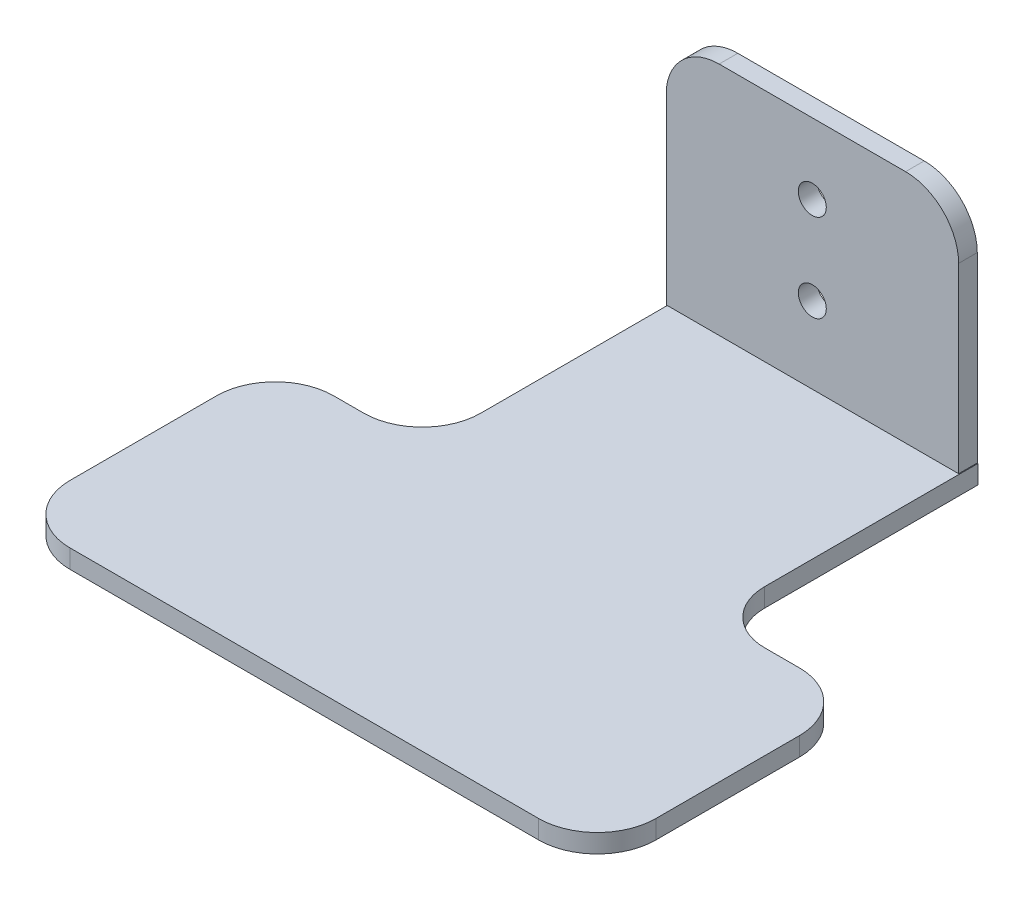
ISO-10303-21;
HEADER;
FILE_DESCRIPTION(('STEP AP214'),'2;1');
FILE_NAME('part.step','',(''),(''),'','','');
FILE_SCHEMA(('AUTOMOTIVE_DESIGN { 1 0 10303 214 1 1 1 1 }'));
ENDSEC;
DATA;
#1=APPLICATION_CONTEXT('core data for automotive mechanical design processes');
#2=APPLICATION_PROTOCOL_DEFINITION('international standard','automotive_design',2000,#1);
#3=PRODUCT_CONTEXT('',#1,'mechanical');
#4=PRODUCT('Part','Part','',(#3));
#5=PRODUCT_RELATED_PRODUCT_CATEGORY('part','',(#4));
#6=PRODUCT_DEFINITION_FORMATION('','',#4);
#7=PRODUCT_DEFINITION_CONTEXT('part definition',#1,'design');
#8=PRODUCT_DEFINITION('design','',#6,#7);
#9=PRODUCT_DEFINITION_SHAPE('','',#8);
#10=(LENGTH_UNIT() NAMED_UNIT(*) SI_UNIT(.MILLI.,.METRE.));
#11=(NAMED_UNIT(*) PLANE_ANGLE_UNIT() SI_UNIT($,.RADIAN.));
#12=(NAMED_UNIT(*) SI_UNIT($,.STERADIAN.) SOLID_ANGLE_UNIT());
#13=UNCERTAINTY_MEASURE_WITH_UNIT(LENGTH_MEASURE(1.E-05),#10,'distance_accuracy_value','');
#14=(GEOMETRIC_REPRESENTATION_CONTEXT(3) GLOBAL_UNCERTAINTY_ASSIGNED_CONTEXT((#13)) GLOBAL_UNIT_ASSIGNED_CONTEXT((#10,
#11,#12)) REPRESENTATION_CONTEXT('',''));
#15=CARTESIAN_POINT('',(0.,0.,0.));
#16=DIRECTION('',(0.,0.,1.));
#17=DIRECTION('',(1.,0.,0.));
#18=AXIS2_PLACEMENT_3D('',#15,#16,#17);
#19=CARTESIAN_POINT('',(22.8862511446096,34.2527379489032,3.18));
#20=DIRECTION('',(0.,0.,1.));
#21=DIRECTION('',(1.,0.,0.));
#22=AXIS2_PLACEMENT_3D('',#19,#20,#21);
#23=PLANE('',#22);
#24=DIRECTION('',(0.,-1.,0.));
#25=VECTOR('',#24,1.);
#26=CARTESIAN_POINT('',(-17.8002165675251,34.2527379489032,3.18));
#27=LINE('',#26,#25);
#28=CARTESIAN_POINT('',(-17.8002165675251,3.18,3.18));
#29=VERTEX_POINT('',#28);
#30=CARTESIAN_POINT('',(-17.8002165675251,0.349476153117412,3.18));
#31=VERTEX_POINT('',#30);
#32=EDGE_CURVE('E51',#29,#31,#27,.T.);
#33=ORIENTED_EDGE('',*,*,#32,.F.);
#34=DIRECTION('',(1.,0.,0.));
#35=VECTOR('',#34,1.);
#36=CARTESIAN_POINT('',(22.8862511446096,3.18,3.18));
#37=LINE('',#36,#35);
#38=CARTESIAN_POINT('',(31.9446232994355,3.18,3.18));
#39=VERTEX_POINT('',#38);
#40=EDGE_CURVE('E206',#29,#39,#37,.T.);
#41=ORIENTED_EDGE('',*,*,#40,.T.);
#42=DIRECTION('',(0.,1.,0.));
#43=VECTOR('',#42,1.);
#44=CARTESIAN_POINT('',(31.9446232994355,0.349476153117412,3.18));
#45=LINE('',#44,#43);
#46=CARTESIAN_POINT('',(31.9446232994355,34.2871040819025,3.18));
#47=VERTEX_POINT('',#46);
#48=EDGE_CURVE('E323',#39,#47,#45,.T.);
#49=ORIENTED_EDGE('',*,*,#48,.T.);
#50=CARTESIAN_POINT('',(22.8862511446096,34.2527379489032,3.18));
#51=DIRECTION('',(0.,0.,1.));
#52=DIRECTION('',(1.,0.,0.));
#53=AXIS2_PLACEMENT_3D('',#50,#51,#52);
#54=CIRCLE('',#53,9.05843734462087);
#55=CARTESIAN_POINT('',(22.8862511446096,43.3111752935241,3.18));
#56=VERTEX_POINT('',#55);
#57=EDGE_CURVE('E326',#47,#56,#54,.T.);
#58=ORIENTED_EDGE('',*,*,#57,.T.);
#59=DIRECTION('',(-1.,0.,0.));
#60=VECTOR('',#59,1.);
#61=CARTESIAN_POINT('',(-8.94233326088786,43.3111752935241,3.18));
#62=LINE('',#61,#60);
#63=CARTESIAN_POINT('',(-8.94233326088786,43.3111752935241,3.18));
#64=VERTEX_POINT('',#63);
#65=EDGE_CURVE('E328',#56,#64,#62,.T.);
#66=ORIENTED_EDGE('',*,*,#65,.T.);
#67=CARTESIAN_POINT('',(-8.94233326088786,34.2527379489032,3.18));
#68=DIRECTION('',(0.,0.,1.));
#69=DIRECTION('',(1.,0.,0.));
#70=AXIS2_PLACEMENT_3D('',#67,#68,#69);
#71=CIRCLE('',#70,9.05843734462087);
#72=CARTESIAN_POINT('',(-17.9252964655178,35.4196394831751,3.18));
#73=VERTEX_POINT('',#72);
#74=EDGE_CURVE('E330',#64,#73,#71,.T.);
#75=ORIENTED_EDGE('',*,*,#74,.T.);
#76=DIRECTION('',(0.,-1.,0.));
#77=VECTOR('',#76,1.);
#78=CARTESIAN_POINT('',(-17.9252964655178,35.4196394831751,3.18));
#79=LINE('',#78,#77);
#80=CARTESIAN_POINT('',(-17.9252964655178,0.349476153117412,3.18));
#81=VERTEX_POINT('',#80);
#82=EDGE_CURVE('E332',#73,#81,#79,.T.);
#83=ORIENTED_EDGE('',*,*,#82,.T.);
#84=DIRECTION('',(1.,0.,0.));
#85=VECTOR('',#84,1.);
#86=CARTESIAN_POINT('',(-17.9252964655178,0.349476153117412,3.18));
#87=LINE('',#86,#85);
#88=EDGE_CURVE('E321',#81,#31,#87,.T.);
#89=ORIENTED_EDGE('',*,*,#88,.T.);
#90=EDGE_LOOP('',(#33,#41,#49,#58,#66,#75,#83,#89));
#91=FACE_BOUND('',#90,.T.);
#92=CARTESIAN_POINT('',(6.95811985188034,16.2527381217677,3.18));
#93=DIRECTION('',(0.,0.,1.));
#94=DIRECTION('',(1.,0.,0.));
#95=AXIS2_PLACEMENT_3D('',#92,#93,#94);
#96=CIRCLE('',#95,2.39);
#97=CARTESIAN_POINT('',(9.34811985188034,16.2527381217677,3.18));
#98=VERTEX_POINT('',#97);
#99=EDGE_CURVE('E315',#98,#98,#96,.T.);
#100=ORIENTED_EDGE('',*,*,#99,.F.);
#101=EDGE_LOOP('',(#100));
#102=FACE_BOUND('',#101,.T.);
#103=CARTESIAN_POINT('',(6.95811985188034,31.2527379489032,3.18));
#104=DIRECTION('',(0.,0.,1.));
#105=DIRECTION('',(1.,0.,0.));
#106=AXIS2_PLACEMENT_3D('',#103,#104,#105);
#107=CIRCLE('',#106,2.39);
#108=CARTESIAN_POINT('',(9.34811985188034,31.2527379489032,3.18));
#109=VERTEX_POINT('',#108);
#110=EDGE_CURVE('E309',#109,#109,#107,.T.);
#111=ORIENTED_EDGE('',*,*,#110,.F.);
#112=EDGE_LOOP('',(#111));
#113=FACE_BOUND('',#112,.T.);
#114=ADVANCED_FACE('F36',(#91,#102,#113),#23,.T.);
#115=CARTESIAN_POINT('',(22.8862511446096,34.2527379489032,0.));
#116=DIRECTION('',(0.,0.,1.));
#117=DIRECTION('',(1.,0.,0.));
#118=AXIS2_PLACEMENT_3D('',#115,#116,#117);
#119=PLANE('',#118);
#120=DIRECTION('',(1.,0.,0.));
#121=VECTOR('',#120,1.);
#122=CARTESIAN_POINT('',(-17.9252964655178,0.349476153117412,0.));
#123=LINE('',#122,#121);
#124=CARTESIAN_POINT('',(-17.9252964655178,0.349476153117412,0.));
#125=VERTEX_POINT('',#124);
#126=CARTESIAN_POINT('',(31.9446232994355,0.349476153117412,0.));
#127=VERTEX_POINT('',#126);
#128=EDGE_CURVE('E318',#125,#127,#123,.T.);
#129=ORIENTED_EDGE('',*,*,#128,.F.);
#130=DIRECTION('',(0.,-1.,0.));
#131=VECTOR('',#130,1.);
#132=CARTESIAN_POINT('',(-17.9252964655178,35.4196394831751,0.));
#133=LINE('',#132,#131);
#134=CARTESIAN_POINT('',(-17.9252964655178,35.4196394831751,0.));
#135=VERTEX_POINT('',#134);
#136=EDGE_CURVE('E324',#135,#125,#133,.T.);
#137=ORIENTED_EDGE('',*,*,#136,.F.);
#138=CARTESIAN_POINT('',(-8.94233326088786,34.2527379489032,0.));
#139=DIRECTION('',(0.,0.,1.));
#140=DIRECTION('',(1.,0.,0.));
#141=AXIS2_PLACEMENT_3D('',#138,#139,#140);
#142=CIRCLE('',#141,9.05843734462087);
#143=CARTESIAN_POINT('',(-8.94233326088786,43.3111752935241,0.));
#144=VERTEX_POINT('',#143);
#145=EDGE_CURVE('E343',#144,#135,#142,.T.);
#146=ORIENTED_EDGE('',*,*,#145,.F.);
#147=DIRECTION('',(-1.,0.,0.));
#148=VECTOR('',#147,1.);
#149=CARTESIAN_POINT('',(-8.94233326088786,43.3111752935241,0.));
#150=LINE('',#149,#148);
#151=CARTESIAN_POINT('',(22.8862511446096,43.3111752935241,0.));
#152=VERTEX_POINT('',#151);
#153=EDGE_CURVE('E341',#152,#144,#150,.T.);
#154=ORIENTED_EDGE('',*,*,#153,.F.);
#155=CARTESIAN_POINT('',(22.8862511446096,34.2527379489032,0.));
#156=DIRECTION('',(0.,0.,1.));
#157=DIRECTION('',(1.,0.,0.));
#158=AXIS2_PLACEMENT_3D('',#155,#156,#157);
#159=CIRCLE('',#158,9.05843734462087);
#160=CARTESIAN_POINT('',(31.9446232994355,34.2871040819025,0.));
#161=VERTEX_POINT('',#160);
#162=EDGE_CURVE('E339',#161,#152,#159,.T.);
#163=ORIENTED_EDGE('',*,*,#162,.F.);
#164=DIRECTION('',(0.,1.,0.));
#165=VECTOR('',#164,1.);
#166=CARTESIAN_POINT('',(31.9446232994355,0.349476153117412,0.));
#167=LINE('',#166,#165);
#168=EDGE_CURVE('E337',#127,#161,#167,.T.);
#169=ORIENTED_EDGE('',*,*,#168,.F.);
#170=EDGE_LOOP('',(#129,#137,#146,#154,#163,#169));
#171=FACE_BOUND('',#170,.T.);
#172=CARTESIAN_POINT('',(6.95811985188034,16.2527381217677,0.));
#173=DIRECTION('',(0.,0.,1.));
#174=DIRECTION('',(1.,0.,0.));
#175=AXIS2_PLACEMENT_3D('',#172,#173,#174);
#176=CIRCLE('',#175,2.39);
#177=CARTESIAN_POINT('',(9.34811985188034,16.2527381217677,0.));
#178=VERTEX_POINT('',#177);
#179=EDGE_CURVE('E312',#178,#178,#176,.T.);
#180=ORIENTED_EDGE('',*,*,#179,.T.);
#181=EDGE_LOOP('',(#180));
#182=FACE_BOUND('',#181,.T.);
#183=CARTESIAN_POINT('',(6.95811985188034,31.2527379489032,0.));
#184=DIRECTION('',(0.,0.,1.));
#185=DIRECTION('',(1.,0.,0.));
#186=AXIS2_PLACEMENT_3D('',#183,#184,#185);
#187=CIRCLE('',#186,2.39);
#188=CARTESIAN_POINT('',(9.34811985188034,31.2527379489032,0.));
#189=VERTEX_POINT('',#188);
#190=EDGE_CURVE('E308',#189,#189,#187,.T.);
#191=ORIENTED_EDGE('',*,*,#190,.T.);
#192=EDGE_LOOP('',(#191));
#193=FACE_BOUND('',#192,.T.);
#194=ADVANCED_FACE('F387',(#171,#182,#193),#119,.F.);
#195=CARTESIAN_POINT('',(-17.9252964655178,0.349476153117412,3.18));
#196=DIRECTION('',(0.,1.,0.));
#197=DIRECTION('',(0.,0.,1.));
#198=AXIS2_PLACEMENT_3D('',#195,#196,#197);
#199=PLANE('',#198);
#200=DIRECTION('',(0.,0.,-1.));
#201=VECTOR('',#200,1.);
#202=CARTESIAN_POINT('',(31.9446232994355,0.349476153117412,3.18));
#203=LINE('',#202,#201);
#204=CARTESIAN_POINT('',(31.9446232994355,0.349476153117412,0.00605745257762323));
#205=VERTEX_POINT('',#204);
#206=EDGE_CURVE('E360',#205,#127,#203,.T.);
#207=ORIENTED_EDGE('',*,*,#206,.F.);
#208=DIRECTION('',(-1.,0.,0.));
#209=VECTOR('',#208,1.);
#210=CARTESIAN_POINT('',(-17.9252964655178,0.349476153117412,0.00605745257762236));
#211=LINE('',#210,#209);
#212=CARTESIAN_POINT('',(-17.8002165675251,0.349476153117412,0.00605745257762236));
#213=VERTEX_POINT('',#212);
#214=EDGE_CURVE('E58',#205,#213,#211,.T.);
#215=ORIENTED_EDGE('',*,*,#214,.T.);
#216=DIRECTION('',(0.,0.,1.));
#217=VECTOR('',#216,1.);
#218=CARTESIAN_POINT('',(-17.8002165675251,0.349476153117412,3.18));
#219=LINE('',#218,#217);
#220=EDGE_CURVE('E11',#213,#31,#219,.T.);
#221=ORIENTED_EDGE('',*,*,#220,.T.);
#222=ORIENTED_EDGE('',*,*,#88,.F.);
#223=DIRECTION('',(0.,0.,-1.));
#224=VECTOR('',#223,1.);
#225=CARTESIAN_POINT('',(-17.9252964655178,0.349476153117412,3.18));
#226=LINE('',#225,#224);
#227=EDGE_CURVE('E334',#81,#125,#226,.T.);
#228=ORIENTED_EDGE('',*,*,#227,.T.);
#229=ORIENTED_EDGE('',*,*,#128,.T.);
#230=EDGE_LOOP('',(#207,#215,#221,#222,#228,#229));
#231=FACE_BOUND('',#230,.T.);
#232=ADVANCED_FACE('F38',(#231),#199,.F.);
#233=CARTESIAN_POINT('',(31.9446232994355,0.349476153117412,3.18));
#234=DIRECTION('',(-1.,0.,0.));
#235=DIRECTION('',(0.,-1.,0.));
#236=AXIS2_PLACEMENT_3D('',#233,#234,#235);
#237=PLANE('',#236);
#238=DIRECTION('',(0.,0.,1.));
#239=VECTOR('',#238,1.);
#240=CARTESIAN_POINT('',(31.9446232994355,3.18,3.18));
#241=LINE('',#240,#239);
#242=CARTESIAN_POINT('',(31.9446232994355,3.18,0.00605745257762236));
#243=VERTEX_POINT('',#242);
#244=EDGE_CURVE('E362',#243,#39,#241,.T.);
#245=ORIENTED_EDGE('',*,*,#244,.F.);
#246=DIRECTION('',(0.,-1.,0.));
#247=VECTOR('',#246,1.);
#248=CARTESIAN_POINT('',(31.9446232994355,0.349476153117412,0.00605745257762236));
#249=LINE('',#248,#247);
#250=EDGE_CURVE('E44',#243,#205,#249,.T.);
#251=ORIENTED_EDGE('',*,*,#250,.T.);
#252=ORIENTED_EDGE('',*,*,#206,.T.);
#253=ORIENTED_EDGE('',*,*,#168,.T.);
#254=DIRECTION('',(0.,0.,-1.));
#255=VECTOR('',#254,1.);
#256=CARTESIAN_POINT('',(31.9446232994355,34.2871040819025,3.18));
#257=LINE('',#256,#255);
#258=EDGE_CURVE('E357',#47,#161,#257,.T.);
#259=ORIENTED_EDGE('',*,*,#258,.F.);
#260=ORIENTED_EDGE('',*,*,#48,.F.);
#261=EDGE_LOOP('',(#245,#251,#252,#253,#259,#260));
#262=FACE_BOUND('',#261,.T.);
#263=ADVANCED_FACE('F366',(#262),#237,.F.);
#264=CARTESIAN_POINT('',(22.8862511446096,34.2527379489032,3.18));
#265=DIRECTION('',(0.,0.,-1.));
#266=DIRECTION('',(-1.,0.,0.));
#267=AXIS2_PLACEMENT_3D('',#264,#265,#266);
#268=CYLINDRICAL_SURFACE('',#267,9.05843734462087);
#269=ORIENTED_EDGE('',*,*,#162,.T.);
#270=DIRECTION('',(0.,0.,-1.));
#271=VECTOR('',#270,1.);
#272=CARTESIAN_POINT('',(22.8862511446096,43.3111752935241,3.18));
#273=LINE('',#272,#271);
#274=EDGE_CURVE('E354',#56,#152,#273,.T.);
#275=ORIENTED_EDGE('',*,*,#274,.F.);
#276=ORIENTED_EDGE('',*,*,#57,.F.);
#277=ORIENTED_EDGE('',*,*,#258,.T.);
#278=EDGE_LOOP('',(#269,#275,#276,#277));
#279=FACE_BOUND('',#278,.T.);
#280=ADVANCED_FACE('F395',(#279),#268,.T.);
#281=CARTESIAN_POINT('',(-8.94233326088786,43.3111752935241,3.18));
#282=DIRECTION('',(0.,-1.,0.));
#283=DIRECTION('',(0.,0.,-1.));
#284=AXIS2_PLACEMENT_3D('',#281,#282,#283);
#285=PLANE('',#284);
#286=ORIENTED_EDGE('',*,*,#153,.T.);
#287=DIRECTION('',(0.,0.,-1.));
#288=VECTOR('',#287,1.);
#289=CARTESIAN_POINT('',(-8.94233326088786,43.3111752935241,3.18));
#290=LINE('',#289,#288);
#291=EDGE_CURVE('E351',#64,#144,#290,.T.);
#292=ORIENTED_EDGE('',*,*,#291,.F.);
#293=ORIENTED_EDGE('',*,*,#65,.F.);
#294=ORIENTED_EDGE('',*,*,#274,.T.);
#295=EDGE_LOOP('',(#286,#292,#293,#294));
#296=FACE_BOUND('',#295,.T.);
#297=ADVANCED_FACE('F467',(#296),#285,.F.);
#298=CARTESIAN_POINT('',(-8.94233326088786,34.2527379489032,3.18));
#299=DIRECTION('',(0.,0.,-1.));
#300=DIRECTION('',(-1.,0.,0.));
#301=AXIS2_PLACEMENT_3D('',#298,#299,#300);
#302=CYLINDRICAL_SURFACE('',#301,9.05843734462087);
#303=ORIENTED_EDGE('',*,*,#145,.T.);
#304=DIRECTION('',(0.,0.,-1.));
#305=VECTOR('',#304,1.);
#306=CARTESIAN_POINT('',(-17.9252964655178,35.4196394831751,3.18));
#307=LINE('',#306,#305);
#308=EDGE_CURVE('E348',#73,#135,#307,.T.);
#309=ORIENTED_EDGE('',*,*,#308,.F.);
#310=ORIENTED_EDGE('',*,*,#74,.F.);
#311=ORIENTED_EDGE('',*,*,#291,.T.);
#312=EDGE_LOOP('',(#303,#309,#310,#311));
#313=FACE_BOUND('',#312,.T.);
#314=ADVANCED_FACE('F464',(#313),#302,.T.);
#315=CARTESIAN_POINT('',(-17.9252964655178,35.4196394831751,3.18));
#316=DIRECTION('',(1.,0.,0.));
#317=DIRECTION('',(0.,0.,-1.));
#318=AXIS2_PLACEMENT_3D('',#315,#316,#317);
#319=PLANE('',#318);
#320=ORIENTED_EDGE('',*,*,#136,.T.);
#321=ORIENTED_EDGE('',*,*,#227,.F.);
#322=ORIENTED_EDGE('',*,*,#82,.F.);
#323=ORIENTED_EDGE('',*,*,#308,.T.);
#324=EDGE_LOOP('',(#320,#321,#322,#323));
#325=FACE_BOUND('',#324,.T.);
#326=ADVANCED_FACE('F384',(#325),#319,.F.);
#327=CARTESIAN_POINT('',(6.95811985188034,16.2527381217677,3.18));
#328=DIRECTION('',(0.,0.,-1.));
#329=DIRECTION('',(-1.,0.,0.));
#330=AXIS2_PLACEMENT_3D('',#327,#328,#329);
#331=CYLINDRICAL_SURFACE('',#330,2.39);
#332=ORIENTED_EDGE('',*,*,#99,.T.);
#333=EDGE_LOOP('',(#332));
#334=FACE_BOUND('',#333,.T.);
#335=ORIENTED_EDGE('',*,*,#179,.F.);
#336=EDGE_LOOP('',(#335));
#337=FACE_BOUND('',#336,.T.);
#338=ADVANCED_FACE('F459',(#334,#337),#331,.F.);
#339=CARTESIAN_POINT('',(6.95811985188034,31.2527379489032,3.18));
#340=DIRECTION('',(0.,0.,-1.));
#341=DIRECTION('',(-1.,0.,0.));
#342=AXIS2_PLACEMENT_3D('',#339,#340,#341);
#343=CYLINDRICAL_SURFACE('',#342,2.39);
#344=ORIENTED_EDGE('',*,*,#110,.T.);
#345=EDGE_LOOP('',(#344));
#346=FACE_BOUND('',#345,.T.);
#347=ORIENTED_EDGE('',*,*,#190,.F.);
#348=EDGE_LOOP('',(#347));
#349=FACE_BOUND('',#348,.T.);
#350=ADVANCED_FACE('F518',(#346,#349),#343,.F.);
#351=CARTESIAN_POINT('',(-17.8002165675251,3.18,0.00605745257762236));
#352=DIRECTION('',(0.,0.,-1.));
#353=DIRECTION('',(-1.,0.,0.));
#354=AXIS2_PLACEMENT_3D('',#351,#352,#353);
#355=PLANE('',#354);
#356=ORIENTED_EDGE('',*,*,#214,.F.);
#357=ORIENTED_EDGE('',*,*,#250,.F.);
#358=DIRECTION('',(1.,0.,0.));
#359=VECTOR('',#358,1.);
#360=CARTESIAN_POINT('',(-17.8002165675251,3.18,0.00605745257762236));
#361=LINE('',#360,#359);
#362=CARTESIAN_POINT('',(32.0747035344822,3.18,0.00605745257762236));
#363=VERTEX_POINT('',#362);
#364=EDGE_CURVE('E239',#243,#363,#361,.T.);
#365=ORIENTED_EDGE('',*,*,#364,.T.);
#366=DIRECTION('',(0.,-1.,0.));
#367=VECTOR('',#366,1.);
#368=CARTESIAN_POINT('',(32.0747035344822,3.18,0.00605745257762236));
#369=LINE('',#368,#367);
#370=CARTESIAN_POINT('',(32.0747035344822,0.,0.00605745257762236));
#371=VERTEX_POINT('',#370);
#372=EDGE_CURVE('E284',#363,#371,#369,.T.);
#373=ORIENTED_EDGE('',*,*,#372,.T.);
#374=DIRECTION('',(1.,0.,0.));
#375=VECTOR('',#374,1.);
#376=CARTESIAN_POINT('',(-17.8002165675251,0.,0.00605745257762236));
#377=LINE('',#376,#375);
#378=CARTESIAN_POINT('',(-17.8002165675251,0.,0.00605745257762236));
#379=VERTEX_POINT('',#378);
#380=EDGE_CURVE('E276',#379,#371,#377,.T.);
#381=ORIENTED_EDGE('',*,*,#380,.F.);
#382=DIRECTION('',(0.,-1.,0.));
#383=VECTOR('',#382,1.);
#384=CARTESIAN_POINT('',(-17.8002165675251,3.18,0.00605745257762236));
#385=LINE('',#384,#383);
#386=EDGE_CURVE('E282',#213,#379,#385,.T.);
#387=ORIENTED_EDGE('',*,*,#386,.F.);
#388=EDGE_LOOP('',(#356,#357,#365,#373,#381,#387));
#389=FACE_BOUND('',#388,.T.);
#390=ADVANCED_FACE('F372',(#389),#355,.T.);
#391=CARTESIAN_POINT('',(-27.8002165675251,3.18,35.0060574525776));
#392=DIRECTION('',(0.,-1.,0.));
#393=DIRECTION('',(0.,0.,-1.));
#394=AXIS2_PLACEMENT_3D('',#391,#392,#393);
#395=CYLINDRICAL_SURFACE('',#394,10.);
#396=CARTESIAN_POINT('',(-27.8002165675251,0.,35.0060574525776));
#397=DIRECTION('',(0.,-1.,0.));
#398=DIRECTION('',(0.,0.,-1.));
#399=AXIS2_PLACEMENT_3D('',#396,#397,#398);
#400=CIRCLE('',#399,10.);
#401=CARTESIAN_POINT('',(-17.8002165675251,0.,35.0060574525776));
#402=VERTEX_POINT('',#401);
#403=CARTESIAN_POINT('',(-27.8002165675251,0.,45.0060574525776));
#404=VERTEX_POINT('',#403);
#405=EDGE_CURVE('E202',#402,#404,#400,.T.);
#406=ORIENTED_EDGE('',*,*,#405,.T.);
#407=DIRECTION('',(0.,-1.,0.));
#408=VECTOR('',#407,1.);
#409=CARTESIAN_POINT('',(-27.8002165675251,3.18,45.0060574525776));
#410=LINE('',#409,#408);
#411=CARTESIAN_POINT('',(-27.8002165675251,3.18,45.0060574525776));
#412=VERTEX_POINT('',#411);
#413=EDGE_CURVE('E199',#412,#404,#410,.T.);
#414=ORIENTED_EDGE('',*,*,#413,.F.);
#415=CARTESIAN_POINT('',(-27.8002165675251,3.18,35.0060574525776));
#416=DIRECTION('',(0.,-1.,0.));
#417=DIRECTION('',(0.,0.,-1.));
#418=AXIS2_PLACEMENT_3D('',#415,#416,#417);
#419=CIRCLE('',#418,10.);
#420=CARTESIAN_POINT('',(-17.8002165675251,3.18,35.0060574525776));
#421=VERTEX_POINT('',#420);
#422=EDGE_CURVE('E188',#421,#412,#419,.T.);
#423=ORIENTED_EDGE('',*,*,#422,.F.);
#424=DIRECTION('',(0.,-1.,0.));
#425=VECTOR('',#424,1.);
#426=CARTESIAN_POINT('',(-17.8002165675251,3.18,35.0060574525776));
#427=LINE('',#426,#425);
#428=EDGE_CURVE('E242',#421,#402,#427,.T.);
#429=ORIENTED_EDGE('',*,*,#428,.T.);
#430=EDGE_LOOP('',(#406,#414,#423,#429));
#431=FACE_BOUND('',#430,.T.);
#432=ADVANCED_FACE('F200',(#431),#395,.F.);
#433=CARTESIAN_POINT('',(-32.9252964655178,3.18,45.0060574525776));
#434=DIRECTION('',(0.,0.,-1.));
#435=DIRECTION('',(-1.,0.,0.));
#436=AXIS2_PLACEMENT_3D('',#433,#434,#435);
#437=PLANE('',#436);
#438=DIRECTION('',(1.,0.,0.));
#439=VECTOR('',#438,1.);
#440=CARTESIAN_POINT('',(-32.9252964655178,0.,45.0060574525776));
#441=LINE('',#440,#439);
#442=CARTESIAN_POINT('',(-32.9252964655178,0.,45.0060574525776));
#443=VERTEX_POINT('',#442);
#444=EDGE_CURVE('E244',#443,#404,#441,.T.);
#445=ORIENTED_EDGE('',*,*,#444,.F.);
#446=DIRECTION('',(0.,-1.,0.));
#447=VECTOR('',#446,1.);
#448=CARTESIAN_POINT('',(-32.9252964655178,3.18,45.0060574525776));
#449=LINE('',#448,#447);
#450=CARTESIAN_POINT('',(-32.9252964655178,3.18,45.0060574525776));
#451=VERTEX_POINT('',#450);
#452=EDGE_CURVE('E207',#451,#443,#449,.T.);
#453=ORIENTED_EDGE('',*,*,#452,.F.);
#454=DIRECTION('',(1.,0.,0.));
#455=VECTOR('',#454,1.);
#456=CARTESIAN_POINT('',(-32.9252964655178,3.18,45.0060574525776));
#457=LINE('',#456,#455);
#458=EDGE_CURVE('E192',#451,#412,#457,.T.);
#459=ORIENTED_EDGE('',*,*,#458,.T.);
#460=ORIENTED_EDGE('',*,*,#413,.T.);
#461=EDGE_LOOP('',(#445,#453,#459,#460));
#462=FACE_BOUND('',#461,.T.);
#463=ADVANCED_FACE('F209',(#462),#437,.T.);
#464=CARTESIAN_POINT('',(-32.9252964655178,3.18,55.0060574525776));
#465=DIRECTION('',(0.,-1.,0.));
#466=DIRECTION('',(0.,0.,-1.));
#467=AXIS2_PLACEMENT_3D('',#464,#465,#466);
#468=CYLINDRICAL_SURFACE('',#467,10.);
#469=CARTESIAN_POINT('',(-32.9252964655178,0.,55.0060574525776));
#470=DIRECTION('',(0.,1.,0.));
#471=DIRECTION('',(0.,0.,1.));
#472=AXIS2_PLACEMENT_3D('',#469,#470,#471);
#473=CIRCLE('',#472,10.);
#474=CARTESIAN_POINT('',(-42.9252964655178,0.,55.0060574525776));
#475=VERTEX_POINT('',#474);
#476=EDGE_CURVE('E246',#443,#475,#473,.T.);
#477=ORIENTED_EDGE('',*,*,#476,.T.);
#478=DIRECTION('',(0.,-1.,0.));
#479=VECTOR('',#478,1.);
#480=CARTESIAN_POINT('',(-42.9252964655178,3.18,55.0060574525776));
#481=LINE('',#480,#479);
#482=CARTESIAN_POINT('',(-42.9252964655178,3.18,55.0060574525776));
#483=VERTEX_POINT('',#482);
#484=EDGE_CURVE('E302',#483,#475,#481,.T.);
#485=ORIENTED_EDGE('',*,*,#484,.F.);
#486=CARTESIAN_POINT('',(-32.9252964655178,3.18,55.0060574525776));
#487=DIRECTION('',(0.,1.,0.));
#488=DIRECTION('',(0.,0.,1.));
#489=AXIS2_PLACEMENT_3D('',#486,#487,#488);
#490=CIRCLE('',#489,10.);
#491=EDGE_CURVE('E211',#451,#483,#490,.T.);
#492=ORIENTED_EDGE('',*,*,#491,.F.);
#493=ORIENTED_EDGE('',*,*,#452,.T.);
#494=EDGE_LOOP('',(#477,#485,#492,#493));
#495=FACE_BOUND('',#494,.T.);
#496=ADVANCED_FACE('F412',(#495),#468,.T.);
#497=CARTESIAN_POINT('',(-42.9252964655178,3.18,80.0060574525776));
#498=DIRECTION('',(-1.,0.,0.));
#499=DIRECTION('',(0.,0.,1.));
#500=AXIS2_PLACEMENT_3D('',#497,#498,#499);
#501=PLANE('',#500);
#502=DIRECTION('',(0.,0.,-1.));
#503=VECTOR('',#502,1.);
#504=CARTESIAN_POINT('',(-42.9252964655178,0.,80.0060574525776));
#505=LINE('',#504,#503);
#506=CARTESIAN_POINT('',(-42.9252964655178,0.,80.0060574525776));
#507=VERTEX_POINT('',#506);
#508=EDGE_CURVE('E249',#507,#475,#505,.T.);
#509=ORIENTED_EDGE('',*,*,#508,.F.);
#510=DIRECTION('',(0.,-1.,0.));
#511=VECTOR('',#510,1.);
#512=CARTESIAN_POINT('',(-42.9252964655178,3.18,80.0060574525776));
#513=LINE('',#512,#511);
#514=CARTESIAN_POINT('',(-42.9252964655178,3.18,80.0060574525776));
#515=VERTEX_POINT('',#514);
#516=EDGE_CURVE('E300',#515,#507,#513,.T.);
#517=ORIENTED_EDGE('',*,*,#516,.F.);
#518=DIRECTION('',(0.,0.,-1.));
#519=VECTOR('',#518,1.);
#520=CARTESIAN_POINT('',(-42.9252964655178,3.18,80.0060574525776));
#521=LINE('',#520,#519);
#522=EDGE_CURVE('E213',#515,#483,#521,.T.);
#523=ORIENTED_EDGE('',*,*,#522,.T.);
#524=ORIENTED_EDGE('',*,*,#484,.T.);
#525=EDGE_LOOP('',(#509,#517,#523,#524));
#526=FACE_BOUND('',#525,.T.);
#527=ADVANCED_FACE('F555',(#526),#501,.T.);
#528=CARTESIAN_POINT('',(-32.9252964655178,3.18,80.0060574525776));
#529=DIRECTION('',(0.,-1.,0.));
#530=DIRECTION('',(0.,0.,-1.));
#531=AXIS2_PLACEMENT_3D('',#528,#529,#530);
#532=CYLINDRICAL_SURFACE('',#531,9.99999999999999);
#533=CARTESIAN_POINT('',(-32.9252964655178,0.,80.0060574525776));
#534=DIRECTION('',(0.,-1.,0.));
#535=DIRECTION('',(0.,0.,-1.));
#536=AXIS2_PLACEMENT_3D('',#533,#534,#535);
#537=CIRCLE('',#536,9.99999999999999);
#538=CARTESIAN_POINT('',(-32.9252964655178,0.,90.0060574525776));
#539=VERTEX_POINT('',#538);
#540=EDGE_CURVE('E252',#539,#507,#537,.T.);
#541=ORIENTED_EDGE('',*,*,#540,.F.);
#542=DIRECTION('',(0.,-1.,0.));
#543=VECTOR('',#542,1.);
#544=CARTESIAN_POINT('',(-32.9252964655178,3.18,90.0060574525776));
#545=LINE('',#544,#543);
#546=CARTESIAN_POINT('',(-32.9252964655178,3.18,90.0060574525776));
#547=VERTEX_POINT('',#546);
#548=EDGE_CURVE('E298',#547,#539,#545,.T.);
#549=ORIENTED_EDGE('',*,*,#548,.F.);
#550=CARTESIAN_POINT('',(-32.9252964655178,3.18,80.0060574525776));
#551=DIRECTION('',(0.,-1.,0.));
#552=DIRECTION('',(0.,0.,-1.));
#553=AXIS2_PLACEMENT_3D('',#550,#551,#552);
#554=CIRCLE('',#553,9.99999999999999);
#555=EDGE_CURVE('E218',#547,#515,#554,.T.);
#556=ORIENTED_EDGE('',*,*,#555,.T.);
#557=ORIENTED_EDGE('',*,*,#516,.T.);
#558=EDGE_LOOP('',(#541,#549,#556,#557));
#559=FACE_BOUND('',#558,.T.);
#560=ADVANCED_FACE('F419',(#559),#532,.T.);
#561=CARTESIAN_POINT('',(47.0747035344822,3.18,90.0060574525776));
#562=DIRECTION('',(0.,0.,1.));
#563=DIRECTION('',(1.,0.,0.));
#564=AXIS2_PLACEMENT_3D('',#561,#562,#563);
#565=PLANE('',#564);
#566=DIRECTION('',(-1.,0.,0.));
#567=VECTOR('',#566,1.);
#568=CARTESIAN_POINT('',(47.0747035344822,0.,90.0060574525776));
#569=LINE('',#568,#567);
#570=CARTESIAN_POINT('',(47.0747035344822,0.,90.0060574525776));
#571=VERTEX_POINT('',#570);
#572=EDGE_CURVE('E255',#571,#539,#569,.T.);
#573=ORIENTED_EDGE('',*,*,#572,.F.);
#574=DIRECTION('',(0.,-1.,0.));
#575=VECTOR('',#574,1.);
#576=CARTESIAN_POINT('',(47.0747035344822,3.18,90.0060574525776));
#577=LINE('',#576,#575);
#578=CARTESIAN_POINT('',(47.0747035344822,3.18,90.0060574525776));
#579=VERTEX_POINT('',#578);
#580=EDGE_CURVE('E296',#579,#571,#577,.T.);
#581=ORIENTED_EDGE('',*,*,#580,.F.);
#582=DIRECTION('',(-1.,0.,0.));
#583=VECTOR('',#582,1.);
#584=CARTESIAN_POINT('',(47.0747035344822,3.18,90.0060574525776));
#585=LINE('',#584,#583);
#586=EDGE_CURVE('E221',#579,#547,#585,.T.);
#587=ORIENTED_EDGE('',*,*,#586,.T.);
#588=ORIENTED_EDGE('',*,*,#548,.T.);
#589=EDGE_LOOP('',(#573,#581,#587,#588));
#590=FACE_BOUND('',#589,.T.);
#591=ADVANCED_FACE('F422',(#590),#565,.T.);
#592=CARTESIAN_POINT('',(47.0747035344822,3.18,80.0060574525776));
#593=DIRECTION('',(0.,-1.,0.));
#594=DIRECTION('',(0.,0.,-1.));
#595=AXIS2_PLACEMENT_3D('',#592,#593,#594);
#596=CYLINDRICAL_SURFACE('',#595,9.99999999999999);
#597=CARTESIAN_POINT('',(47.0747035344822,0.,80.0060574525776));
#598=DIRECTION('',(0.,1.,0.));
#599=DIRECTION('',(0.,0.,1.));
#600=AXIS2_PLACEMENT_3D('',#597,#598,#599);
#601=CIRCLE('',#600,9.99999999999999);
#602=CARTESIAN_POINT('',(57.0747035344822,0.,80.0060574525776));
#603=VERTEX_POINT('',#602);
#604=EDGE_CURVE('E258',#571,#603,#601,.T.);
#605=ORIENTED_EDGE('',*,*,#604,.T.);
#606=DIRECTION('',(0.,-1.,0.));
#607=VECTOR('',#606,1.);
#608=CARTESIAN_POINT('',(57.0747035344822,3.18,80.0060574525776));
#609=LINE('',#608,#607);
#610=CARTESIAN_POINT('',(57.0747035344822,3.18,80.0060574525776));
#611=VERTEX_POINT('',#610);
#612=EDGE_CURVE('E294',#611,#603,#609,.T.);
#613=ORIENTED_EDGE('',*,*,#612,.F.);
#614=CARTESIAN_POINT('',(47.0747035344822,3.18,80.0060574525776));
#615=DIRECTION('',(0.,1.,0.));
#616=DIRECTION('',(0.,0.,1.));
#617=AXIS2_PLACEMENT_3D('',#614,#615,#616);
#618=CIRCLE('',#617,9.99999999999999);
#619=EDGE_CURVE('E224',#579,#611,#618,.T.);
#620=ORIENTED_EDGE('',*,*,#619,.F.);
#621=ORIENTED_EDGE('',*,*,#580,.T.);
#622=EDGE_LOOP('',(#605,#613,#620,#621));
#623=FACE_BOUND('',#622,.T.);
#624=ADVANCED_FACE('F427',(#623),#596,.T.);
#625=CARTESIAN_POINT('',(57.0747035344822,3.18,55.4773233820515));
#626=DIRECTION('',(1.,0.,0.));
#627=DIRECTION('',(0.,0.,-1.));
#628=AXIS2_PLACEMENT_3D('',#625,#626,#627);
#629=PLANE('',#628);
#630=DIRECTION('',(0.,0.,1.));
#631=VECTOR('',#630,1.);
#632=CARTESIAN_POINT('',(57.0747035344822,0.,55.4773233820515));
#633=LINE('',#632,#631);
#634=CARTESIAN_POINT('',(57.0747035344822,0.,55.4773233820515));
#635=VERTEX_POINT('',#634);
#636=EDGE_CURVE('E261',#635,#603,#633,.T.);
#637=ORIENTED_EDGE('',*,*,#636,.F.);
#638=DIRECTION('',(0.,-1.,0.));
#639=VECTOR('',#638,1.);
#640=CARTESIAN_POINT('',(57.0747035344822,3.18,55.4773233820515));
#641=LINE('',#640,#639);
#642=CARTESIAN_POINT('',(57.0747035344822,3.18,55.4773233820515));
#643=VERTEX_POINT('',#642);
#644=EDGE_CURVE('E292',#643,#635,#641,.T.);
#645=ORIENTED_EDGE('',*,*,#644,.F.);
#646=DIRECTION('',(0.,0.,1.));
#647=VECTOR('',#646,1.);
#648=CARTESIAN_POINT('',(57.0747035344822,3.18,55.4773233820515));
#649=LINE('',#648,#647);
#650=EDGE_CURVE('E226',#643,#611,#649,.T.);
#651=ORIENTED_EDGE('',*,*,#650,.T.);
#652=ORIENTED_EDGE('',*,*,#612,.T.);
#653=EDGE_LOOP('',(#637,#645,#651,#652));
#654=FACE_BOUND('',#653,.T.);
#655=ADVANCED_FACE('F431',(#654),#629,.T.);
#656=CARTESIAN_POINT('',(47.0747035344822,3.18,55.4773233820515));
#657=DIRECTION('',(0.,-1.,0.));
#658=DIRECTION('',(0.,0.,-1.));
#659=AXIS2_PLACEMENT_3D('',#656,#657,#658);
#660=CYLINDRICAL_SURFACE('',#659,10.);
#661=CARTESIAN_POINT('',(47.0747035344822,0.,55.4773233820515));
#662=DIRECTION('',(0.,1.,0.));
#663=DIRECTION('',(0.,0.,1.));
#664=AXIS2_PLACEMENT_3D('',#661,#662,#663);
#665=CIRCLE('',#664,10.);
#666=CARTESIAN_POINT('',(47.0747035344822,0.,45.4773233820515));
#667=VERTEX_POINT('',#666);
#668=EDGE_CURVE('E264',#635,#667,#665,.T.);
#669=ORIENTED_EDGE('',*,*,#668,.T.);
#670=DIRECTION('',(0.,-1.,0.));
#671=VECTOR('',#670,1.);
#672=CARTESIAN_POINT('',(47.0747035344822,3.18,45.4773233820515));
#673=LINE('',#672,#671);
#674=CARTESIAN_POINT('',(47.0747035344822,3.18,45.4773233820515));
#675=VERTEX_POINT('',#674);
#676=EDGE_CURVE('E290',#675,#667,#673,.T.);
#677=ORIENTED_EDGE('',*,*,#676,.F.);
#678=CARTESIAN_POINT('',(47.0747035344822,3.18,55.4773233820515));
#679=DIRECTION('',(0.,1.,0.));
#680=DIRECTION('',(0.,0.,1.));
#681=AXIS2_PLACEMENT_3D('',#678,#679,#680);
#682=CIRCLE('',#681,10.);
#683=EDGE_CURVE('E229',#643,#675,#682,.T.);
#684=ORIENTED_EDGE('',*,*,#683,.F.);
#685=ORIENTED_EDGE('',*,*,#644,.T.);
#686=EDGE_LOOP('',(#669,#677,#684,#685));
#687=FACE_BOUND('',#686,.T.);
#688=ADVANCED_FACE('F436',(#687),#660,.T.);
#689=CARTESIAN_POINT('',(41.1331408791031,3.18,45.4773233820515));
#690=DIRECTION('',(0.,0.,-1.));
#691=DIRECTION('',(-1.,0.,0.));
#692=AXIS2_PLACEMENT_3D('',#689,#690,#691);
#693=PLANE('',#692);
#694=DIRECTION('',(1.,0.,0.));
#695=VECTOR('',#694,1.);
#696=CARTESIAN_POINT('',(41.1331408791031,0.,45.4773233820515));
#697=LINE('',#696,#695);
#698=CARTESIAN_POINT('',(41.1331408791031,0.,45.4773233820515));
#699=VERTEX_POINT('',#698);
#700=EDGE_CURVE('E267',#699,#667,#697,.T.);
#701=ORIENTED_EDGE('',*,*,#700,.F.);
#702=DIRECTION('',(0.,-1.,0.));
#703=VECTOR('',#702,1.);
#704=CARTESIAN_POINT('',(41.1331408791031,3.18,45.4773233820515));
#705=LINE('',#704,#703);
#706=CARTESIAN_POINT('',(41.1331408791031,3.18,45.4773233820515));
#707=VERTEX_POINT('',#706);
#708=EDGE_CURVE('E288',#707,#699,#705,.T.);
#709=ORIENTED_EDGE('',*,*,#708,.F.);
#710=DIRECTION('',(1.,0.,0.));
#711=VECTOR('',#710,1.);
#712=CARTESIAN_POINT('',(41.1331408791031,3.18,45.4773233820515));
#713=LINE('',#712,#711);
#714=EDGE_CURVE('E231',#707,#675,#713,.T.);
#715=ORIENTED_EDGE('',*,*,#714,.T.);
#716=ORIENTED_EDGE('',*,*,#676,.T.);
#717=EDGE_LOOP('',(#701,#709,#715,#716));
#718=FACE_BOUND('',#717,.T.);
#719=ADVANCED_FACE('F441',(#718),#693,.T.);
#720=CARTESIAN_POINT('',(41.1331408791031,3.18,36.4188860374307));
#721=DIRECTION('',(0.,-1.,0.));
#722=DIRECTION('',(0.,0.,-1.));
#723=AXIS2_PLACEMENT_3D('',#720,#721,#722);
#724=CYLINDRICAL_SURFACE('',#723,9.05843734462087);
#725=CARTESIAN_POINT('',(41.1331408791031,0.,36.4188860374307));
#726=DIRECTION('',(0.,-1.,0.));
#727=DIRECTION('',(0.,0.,-1.));
#728=AXIS2_PLACEMENT_3D('',#725,#726,#727);
#729=CIRCLE('',#728,9.05843734462087);
#730=CARTESIAN_POINT('',(32.0747035344822,0.,36.4188860374307));
#731=VERTEX_POINT('',#730);
#732=EDGE_CURVE('E270',#699,#731,#729,.T.);
#733=ORIENTED_EDGE('',*,*,#732,.T.);
#734=DIRECTION('',(0.,-1.,0.));
#735=VECTOR('',#734,1.);
#736=CARTESIAN_POINT('',(32.0747035344822,3.18,36.4188860374307));
#737=LINE('',#736,#735);
#738=CARTESIAN_POINT('',(32.0747035344822,3.18,36.4188860374307));
#739=VERTEX_POINT('',#738);
#740=EDGE_CURVE('E286',#739,#731,#737,.T.);
#741=ORIENTED_EDGE('',*,*,#740,.F.);
#742=CARTESIAN_POINT('',(41.1331408791031,3.18,36.4188860374307));
#743=DIRECTION('',(0.,-1.,0.));
#744=DIRECTION('',(0.,0.,-1.));
#745=AXIS2_PLACEMENT_3D('',#742,#743,#744);
#746=CIRCLE('',#745,9.05843734462087);
#747=EDGE_CURVE('E234',#707,#739,#746,.T.);
#748=ORIENTED_EDGE('',*,*,#747,.F.);
#749=ORIENTED_EDGE('',*,*,#708,.T.);
#750=EDGE_LOOP('',(#733,#741,#748,#749));
#751=FACE_BOUND('',#750,.T.);
#752=ADVANCED_FACE('F443',(#751),#724,.F.);
#753=CARTESIAN_POINT('',(32.0747035344822,3.18,0.00605745257762236));
#754=DIRECTION('',(1.,0.,0.));
#755=DIRECTION('',(0.,0.,-1.));
#756=AXIS2_PLACEMENT_3D('',#753,#754,#755);
#757=PLANE('',#756);
#758=DIRECTION('',(0.,0.,1.));
#759=VECTOR('',#758,1.);
#760=CARTESIAN_POINT('',(32.0747035344822,0.,0.00605745257762236));
#761=LINE('',#760,#759);
#762=EDGE_CURVE('E273',#371,#731,#761,.T.);
#763=ORIENTED_EDGE('',*,*,#762,.F.);
#764=ORIENTED_EDGE('',*,*,#372,.F.);
#765=DIRECTION('',(0.,0.,1.));
#766=VECTOR('',#765,1.);
#767=CARTESIAN_POINT('',(32.0747035344822,3.18,0.00605745257762236));
#768=LINE('',#767,#766);
#769=EDGE_CURVE('E236',#363,#739,#768,.T.);
#770=ORIENTED_EDGE('',*,*,#769,.T.);
#771=ORIENTED_EDGE('',*,*,#740,.T.);
#772=EDGE_LOOP('',(#763,#764,#770,#771));
#773=FACE_BOUND('',#772,.T.);
#774=ADVANCED_FACE('F403',(#773),#757,.T.);
#775=CARTESIAN_POINT('',(-17.8002165675251,3.18,35.0060574525776));
#776=DIRECTION('',(-1.,0.,0.));
#777=DIRECTION('',(0.,0.,1.));
#778=AXIS2_PLACEMENT_3D('',#775,#776,#777);
#779=PLANE('',#778);
#780=DIRECTION('',(0.,0.,-1.));
#781=VECTOR('',#780,1.);
#782=CARTESIAN_POINT('',(-17.8002165675251,3.18,35.0060574525776));
#783=LINE('',#782,#781);
#784=EDGE_CURVE('E194',#421,#29,#783,.T.);
#785=ORIENTED_EDGE('',*,*,#784,.T.);
#786=ORIENTED_EDGE('',*,*,#32,.T.);
#787=ORIENTED_EDGE('',*,*,#220,.F.);
#788=ORIENTED_EDGE('',*,*,#386,.T.);
#789=DIRECTION('',(0.,0.,-1.));
#790=VECTOR('',#789,1.);
#791=CARTESIAN_POINT('',(-17.8002165675251,0.,35.0060574525776));
#792=LINE('',#791,#790);
#793=EDGE_CURVE('E196',#402,#379,#792,.T.);
#794=ORIENTED_EDGE('',*,*,#793,.F.);
#795=ORIENTED_EDGE('',*,*,#428,.F.);
#796=EDGE_LOOP('',(#785,#786,#787,#788,#794,#795));
#797=FACE_BOUND('',#796,.T.);
#798=ADVANCED_FACE('F376',(#797),#779,.T.);
#799=CARTESIAN_POINT('',(-27.8002165675251,3.18,35.0060574525776));
#800=DIRECTION('',(0.,-1.,0.));
#801=DIRECTION('',(0.,0.,-1.));
#802=AXIS2_PLACEMENT_3D('',#799,#800,#801);
#803=PLANE('',#802);
#804=ORIENTED_EDGE('',*,*,#40,.F.);
#805=ORIENTED_EDGE('',*,*,#784,.F.);
#806=ORIENTED_EDGE('',*,*,#422,.T.);
#807=ORIENTED_EDGE('',*,*,#458,.F.);
#808=ORIENTED_EDGE('',*,*,#491,.T.);
#809=ORIENTED_EDGE('',*,*,#522,.F.);
#810=ORIENTED_EDGE('',*,*,#555,.F.);
#811=ORIENTED_EDGE('',*,*,#586,.F.);
#812=ORIENTED_EDGE('',*,*,#619,.T.);
#813=ORIENTED_EDGE('',*,*,#650,.F.);
#814=ORIENTED_EDGE('',*,*,#683,.T.);
#815=ORIENTED_EDGE('',*,*,#714,.F.);
#816=ORIENTED_EDGE('',*,*,#747,.T.);
#817=ORIENTED_EDGE('',*,*,#769,.F.);
#818=ORIENTED_EDGE('',*,*,#364,.F.);
#819=ORIENTED_EDGE('',*,*,#244,.T.);
#820=EDGE_LOOP('',(#804,#805,#806,#807,#808,#809,#810,#811,#812,#813,#814,#815,#816,#817,#818,#819));
#821=FACE_BOUND('',#820,.T.);
#822=ADVANCED_FACE('F190',(#821),#803,.F.);
#823=CARTESIAN_POINT('',(-27.8002165675251,0.,35.0060574525776));
#824=DIRECTION('',(0.,-1.,0.));
#825=DIRECTION('',(0.,0.,-1.));
#826=AXIS2_PLACEMENT_3D('',#823,#824,#825);
#827=PLANE('',#826);
#828=ORIENTED_EDGE('',*,*,#405,.F.);
#829=ORIENTED_EDGE('',*,*,#793,.T.);
#830=ORIENTED_EDGE('',*,*,#380,.T.);
#831=ORIENTED_EDGE('',*,*,#762,.T.);
#832=ORIENTED_EDGE('',*,*,#732,.F.);
#833=ORIENTED_EDGE('',*,*,#700,.T.);
#834=ORIENTED_EDGE('',*,*,#668,.F.);
#835=ORIENTED_EDGE('',*,*,#636,.T.);
#836=ORIENTED_EDGE('',*,*,#604,.F.);
#837=ORIENTED_EDGE('',*,*,#572,.T.);
#838=ORIENTED_EDGE('',*,*,#540,.T.);
#839=ORIENTED_EDGE('',*,*,#508,.T.);
#840=ORIENTED_EDGE('',*,*,#476,.F.);
#841=ORIENTED_EDGE('',*,*,#444,.T.);
#842=EDGE_LOOP('',(#828,#829,#830,#831,#832,#833,#834,#835,#836,#837,#838,#839,#840,#841));
#843=FACE_BOUND('',#842,.T.);
#844=ADVANCED_FACE('F407',(#843),#827,.T.);
#845=CLOSED_SHELL('',(#114,#194,#232,#263,#280,#297,#314,#326,#338,#350,#390,#432,#463,#496,
#527,#560,#591,#624,#655,#688,#719,#752,#774,#798,#822,#844));
#846=MANIFOLD_SOLID_BREP('B2',#845);
#847=ADVANCED_BREP_SHAPE_REPRESENTATION('',(#18,#846),#14);
#848=SHAPE_DEFINITION_REPRESENTATION(#9,#847);
ENDSEC;
END-ISO-10303-21;
